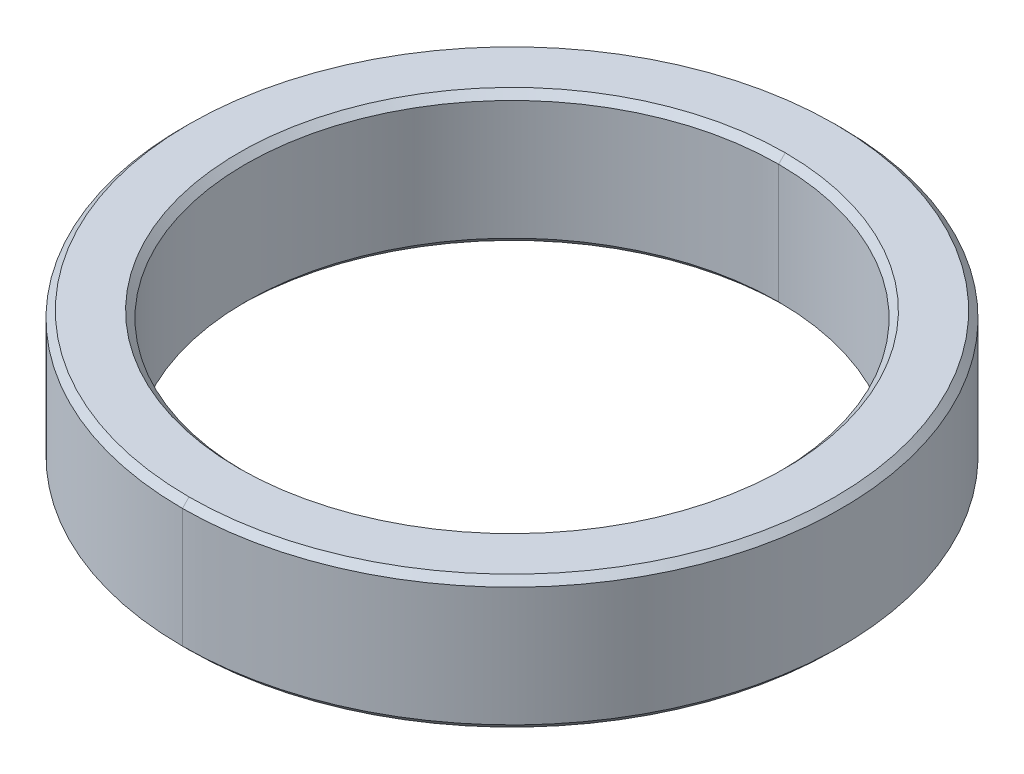
ISO-10303-21;
HEADER;
FILE_DESCRIPTION(('STEP AP214'),'2;1');
FILE_NAME('part.step','',(''),(''),'','','');
FILE_SCHEMA(('AUTOMOTIVE_DESIGN { 1 0 10303 214 1 1 1 1 }'));
ENDSEC;
DATA;
#1=APPLICATION_CONTEXT('core data for automotive mechanical design processes');
#2=APPLICATION_PROTOCOL_DEFINITION('international standard','automotive_design',2000,#1);
#3=PRODUCT_CONTEXT('',#1,'mechanical');
#4=PRODUCT('Part','Part','',(#3));
#5=PRODUCT_RELATED_PRODUCT_CATEGORY('part','',(#4));
#6=PRODUCT_DEFINITION_FORMATION('','',#4);
#7=PRODUCT_DEFINITION_CONTEXT('part definition',#1,'design');
#8=PRODUCT_DEFINITION('design','',#6,#7);
#9=PRODUCT_DEFINITION_SHAPE('','',#8);
#10=(LENGTH_UNIT() NAMED_UNIT(*) SI_UNIT(.MILLI.,.METRE.));
#11=(NAMED_UNIT(*) PLANE_ANGLE_UNIT() SI_UNIT($,.RADIAN.));
#12=(NAMED_UNIT(*) SI_UNIT($,.STERADIAN.) SOLID_ANGLE_UNIT());
#13=UNCERTAINTY_MEASURE_WITH_UNIT(LENGTH_MEASURE(1.E-05),#10,'distance_accuracy_value','');
#14=(GEOMETRIC_REPRESENTATION_CONTEXT(3) GLOBAL_UNCERTAINTY_ASSIGNED_CONTEXT((#13)) GLOBAL_UNIT_ASSIGNED_CONTEXT((#10,
#11,#12)) REPRESENTATION_CONTEXT('',''));
#15=CARTESIAN_POINT('',(0.,0.,0.));
#16=DIRECTION('',(0.,0.,1.));
#17=DIRECTION('',(1.,0.,0.));
#18=AXIS2_PLACEMENT_3D('',#15,#16,#17);
#19=CARTESIAN_POINT('',(0.,0.9,0.));
#20=DIRECTION('',(0.,1.,0.));
#21=DIRECTION('',(0.,0.,1.));
#22=AXIS2_PLACEMENT_3D('',#19,#20,#21);
#23=CONICAL_SURFACE('',#22,4.025,0.785398163397452);
#24=DIRECTION('',(0.,0.707106781186545,-0.707106781186551));
#25=VECTOR('',#24,1.);
#26=CARTESIAN_POINT('',(0.,0.9,-4.025));
#27=LINE('',#26,#25);
#28=CARTESIAN_POINT('',(0.,0.9,-4.025));
#29=VERTEX_POINT('',#28);
#30=CARTESIAN_POINT('',(0.,1.,-4.125));
#31=VERTEX_POINT('',#30);
#32=EDGE_CURVE('E189',#29,#31,#27,.T.);
#33=ORIENTED_EDGE('',*,*,#32,.F.);
#34=CARTESIAN_POINT('',(0.,0.9,0.));
#35=DIRECTION('',(0.,1.,0.));
#36=DIRECTION('',(0.,0.,1.));
#37=AXIS2_PLACEMENT_3D('',#34,#35,#36);
#38=CIRCLE('',#37,4.025);
#39=CARTESIAN_POINT('',(0.,0.9,4.025));
#40=VERTEX_POINT('',#39);
#41=EDGE_CURVE('E26',#40,#29,#38,.T.);
#42=ORIENTED_EDGE('',*,*,#41,.F.);
#43=DIRECTION('',(0.,0.707106781186545,0.707106781186551));
#44=VECTOR('',#43,1.);
#45=CARTESIAN_POINT('',(0.,0.9,4.025));
#46=LINE('',#45,#44);
#47=CARTESIAN_POINT('',(0.,1.,4.125));
#48=VERTEX_POINT('',#47);
#49=EDGE_CURVE('E183',#40,#48,#46,.T.);
#50=ORIENTED_EDGE('',*,*,#49,.T.);
#51=CARTESIAN_POINT('',(0.,1.,0.));
#52=DIRECTION('',(0.,-1.,0.));
#53=DIRECTION('',(0.,0.,1.));
#54=AXIS2_PLACEMENT_3D('',#51,#52,#53);
#55=CIRCLE('',#54,4.125);
#56=EDGE_CURVE('E65',#31,#48,#55,.T.);
#57=ORIENTED_EDGE('',*,*,#56,.F.);
#58=EDGE_LOOP('',(#33,#42,#50,#57));
#59=FACE_BOUND('',#58,.T.);
#60=ADVANCED_FACE('F15',(#59),#23,.F.);
#61=CARTESIAN_POINT('',(0.,-1.,0.));
#62=DIRECTION('',(0.,-1.,0.));
#63=DIRECTION('',(0.,0.,-1.));
#64=AXIS2_PLACEMENT_3D('',#61,#62,#63);
#65=CONICAL_SURFACE('',#64,4.125,0.785398163397448);
#66=DIRECTION('',(0.,-0.707106781186548,0.707106781186548));
#67=VECTOR('',#66,1.);
#68=CARTESIAN_POINT('',(0.,-1.,4.125));
#69=LINE('',#68,#67);
#70=CARTESIAN_POINT('',(0.,-0.9,4.025));
#71=VERTEX_POINT('',#70);
#72=CARTESIAN_POINT('',(0.,-1.,4.125));
#73=VERTEX_POINT('',#72);
#74=EDGE_CURVE('E164',#71,#73,#69,.T.);
#75=ORIENTED_EDGE('',*,*,#74,.F.);
#76=CARTESIAN_POINT('',(0.,-0.9,0.));
#77=DIRECTION('',(0.,-1.,0.));
#78=DIRECTION('',(0.,0.,1.));
#79=AXIS2_PLACEMENT_3D('',#76,#77,#78);
#80=CIRCLE('',#79,4.025);
#81=CARTESIAN_POINT('',(0.,-0.9,-4.025));
#82=VERTEX_POINT('',#81);
#83=EDGE_CURVE('E10',#82,#71,#80,.T.);
#84=ORIENTED_EDGE('',*,*,#83,.F.);
#85=DIRECTION('',(0.,-0.707106781186548,-0.707106781186548));
#86=VECTOR('',#85,1.);
#87=CARTESIAN_POINT('',(0.,-1.,-4.125));
#88=LINE('',#87,#86);
#89=CARTESIAN_POINT('',(0.,-1.,-4.125));
#90=VERTEX_POINT('',#89);
#91=EDGE_CURVE('E196',#82,#90,#88,.T.);
#92=ORIENTED_EDGE('',*,*,#91,.T.);
#93=CARTESIAN_POINT('',(0.,-1.,0.));
#94=DIRECTION('',(0.,1.,0.));
#95=DIRECTION('',(0.,0.,1.));
#96=AXIS2_PLACEMENT_3D('',#93,#94,#95);
#97=CIRCLE('',#96,4.125);
#98=EDGE_CURVE('E129',#73,#90,#97,.T.);
#99=ORIENTED_EDGE('',*,*,#98,.F.);
#100=EDGE_LOOP('',(#75,#84,#92,#99));
#101=FACE_BOUND('',#100,.T.);
#102=ADVANCED_FACE('F315',(#101),#65,.F.);
#103=CARTESIAN_POINT('',(0.,1.,0.));
#104=DIRECTION('',(0.,-1.,0.));
#105=DIRECTION('',(0.,0.,-1.));
#106=AXIS2_PLACEMENT_3D('',#103,#104,#105);
#107=CONICAL_SURFACE('',#106,4.875,0.785398163397453);
#108=DIRECTION('',(0.,-0.707106781186544,0.707106781186551));
#109=VECTOR('',#108,1.);
#110=CARTESIAN_POINT('',(0.,1.,4.875));
#111=LINE('',#110,#109);
#112=CARTESIAN_POINT('',(0.,1.,4.875));
#113=VERTEX_POINT('',#112);
#114=CARTESIAN_POINT('',(0.,0.9,4.975));
#115=VERTEX_POINT('',#114);
#116=EDGE_CURVE('E152',#113,#115,#111,.T.);
#117=ORIENTED_EDGE('',*,*,#116,.F.);
#118=CARTESIAN_POINT('',(0.,1.,0.));
#119=DIRECTION('',(0.,1.,0.));
#120=DIRECTION('',(0.,0.,1.));
#121=AXIS2_PLACEMENT_3D('',#118,#119,#120);
#122=CIRCLE('',#121,4.875);
#123=CARTESIAN_POINT('',(0.,1.,-4.875));
#124=VERTEX_POINT('',#123);
#125=EDGE_CURVE('E140',#124,#113,#122,.T.);
#126=ORIENTED_EDGE('',*,*,#125,.F.);
#127=DIRECTION('',(0.,-0.707106781186544,-0.707106781186551));
#128=VECTOR('',#127,1.);
#129=CARTESIAN_POINT('',(0.,1.,-4.875));
#130=LINE('',#129,#128);
#131=CARTESIAN_POINT('',(0.,0.9,-4.975));
#132=VERTEX_POINT('',#131);
#133=EDGE_CURVE('E143',#124,#132,#130,.T.);
#134=ORIENTED_EDGE('',*,*,#133,.T.);
#135=CARTESIAN_POINT('',(0.,0.9,0.));
#136=DIRECTION('',(0.,-1.,0.));
#137=DIRECTION('',(0.,0.,1.));
#138=AXIS2_PLACEMENT_3D('',#135,#136,#137);
#139=CIRCLE('',#138,4.975);
#140=EDGE_CURVE('E118',#115,#132,#139,.T.);
#141=ORIENTED_EDGE('',*,*,#140,.F.);
#142=EDGE_LOOP('',(#117,#126,#134,#141));
#143=FACE_BOUND('',#142,.T.);
#144=ADVANCED_FACE('F144',(#143),#107,.T.);
#145=CARTESIAN_POINT('',(0.,-0.9,0.));
#146=DIRECTION('',(0.,1.,0.));
#147=DIRECTION('',(0.,0.,1.));
#148=AXIS2_PLACEMENT_3D('',#145,#146,#147);
#149=CONICAL_SURFACE('',#148,4.975,0.785398163397448);
#150=DIRECTION('',(0.,0.707106781186548,-0.707106781186548));
#151=VECTOR('',#150,1.);
#152=CARTESIAN_POINT('',(0.,-0.9,-4.975));
#153=LINE('',#152,#151);
#154=CARTESIAN_POINT('',(0.,-1.,-4.875));
#155=VERTEX_POINT('',#154);
#156=CARTESIAN_POINT('',(0.,-0.9,-4.975));
#157=VERTEX_POINT('',#156);
#158=EDGE_CURVE('E166',#155,#157,#153,.T.);
#159=ORIENTED_EDGE('',*,*,#158,.F.);
#160=CARTESIAN_POINT('',(0.,-1.,0.));
#161=DIRECTION('',(0.,-1.,0.));
#162=DIRECTION('',(0.,0.,1.));
#163=AXIS2_PLACEMENT_3D('',#160,#161,#162);
#164=CIRCLE('',#163,4.875);
#165=CARTESIAN_POINT('',(0.,-1.,4.875));
#166=VERTEX_POINT('',#165);
#167=EDGE_CURVE('E108',#166,#155,#164,.T.);
#168=ORIENTED_EDGE('',*,*,#167,.F.);
#169=DIRECTION('',(0.,0.707106781186548,0.707106781186548));
#170=VECTOR('',#169,1.);
#171=CARTESIAN_POINT('',(0.,-0.9,4.975));
#172=LINE('',#171,#170);
#173=CARTESIAN_POINT('',(0.,-0.9,4.975));
#174=VERTEX_POINT('',#173);
#175=EDGE_CURVE('E178',#166,#174,#172,.T.);
#176=ORIENTED_EDGE('',*,*,#175,.T.);
#177=CARTESIAN_POINT('',(0.,-0.9,0.));
#178=DIRECTION('',(0.,1.,0.));
#179=DIRECTION('',(0.,0.,1.));
#180=AXIS2_PLACEMENT_3D('',#177,#178,#179);
#181=CIRCLE('',#180,4.975);
#182=EDGE_CURVE('E41',#157,#174,#181,.T.);
#183=ORIENTED_EDGE('',*,*,#182,.F.);
#184=EDGE_LOOP('',(#159,#168,#176,#183));
#185=FACE_BOUND('',#184,.T.);
#186=ADVANCED_FACE('F269',(#185),#149,.T.);
#187=CARTESIAN_POINT('',(0.,1.,0.));
#188=DIRECTION('',(0.,-1.,0.));
#189=DIRECTION('',(0.,0.,-1.));
#190=AXIS2_PLACEMENT_3D('',#187,#188,#189);
#191=CYLINDRICAL_SURFACE('',#190,4.025);
#192=DIRECTION('',(0.,-1.,0.));
#193=VECTOR('',#192,1.);
#194=CARTESIAN_POINT('',(0.,1.,4.025));
#195=LINE('',#194,#193);
#196=EDGE_CURVE('E174',#40,#71,#195,.T.);
#197=ORIENTED_EDGE('',*,*,#196,.F.);
#198=ORIENTED_EDGE('',*,*,#41,.T.);
#199=DIRECTION('',(0.,-1.,0.));
#200=VECTOR('',#199,1.);
#201=CARTESIAN_POINT('',(0.,1.,-4.025));
#202=LINE('',#201,#200);
#203=EDGE_CURVE('E170',#29,#82,#202,.T.);
#204=ORIENTED_EDGE('',*,*,#203,.T.);
#205=ORIENTED_EDGE('',*,*,#83,.T.);
#206=EDGE_LOOP('',(#197,#198,#204,#205));
#207=FACE_BOUND('',#206,.T.);
#208=ADVANCED_FACE('F248',(#207),#191,.F.);
#209=CARTESIAN_POINT('',(0.,1.,0.));
#210=DIRECTION('',(0.,-1.,0.));
#211=DIRECTION('',(0.,0.,-1.));
#212=AXIS2_PLACEMENT_3D('',#209,#210,#211);
#213=CYLINDRICAL_SURFACE('',#212,4.975);
#214=DIRECTION('',(0.,-1.,0.));
#215=VECTOR('',#214,1.);
#216=CARTESIAN_POINT('',(0.,1.,4.975));
#217=LINE('',#216,#215);
#218=EDGE_CURVE('E123',#115,#174,#217,.T.);
#219=ORIENTED_EDGE('',*,*,#218,.F.);
#220=ORIENTED_EDGE('',*,*,#140,.T.);
#221=DIRECTION('',(0.,-1.,0.));
#222=VECTOR('',#221,1.);
#223=CARTESIAN_POINT('',(0.,1.,-4.975));
#224=LINE('',#223,#222);
#225=EDGE_CURVE('E121',#132,#157,#224,.T.);
#226=ORIENTED_EDGE('',*,*,#225,.T.);
#227=ORIENTED_EDGE('',*,*,#182,.T.);
#228=EDGE_LOOP('',(#219,#220,#226,#227));
#229=FACE_BOUND('',#228,.T.);
#230=ADVANCED_FACE('F120',(#229),#213,.T.);
#231=CARTESIAN_POINT('',(0.,-1.,0.));
#232=DIRECTION('',(0.,1.,0.));
#233=DIRECTION('',(1.,0.,0.));
#234=AXIS2_PLACEMENT_3D('',#231,#232,#233);
#235=PLANE('',#234);
#236=CARTESIAN_POINT('',(0.,-1.,0.));
#237=DIRECTION('',(0.,1.,0.));
#238=DIRECTION('',(0.,0.,1.));
#239=AXIS2_PLACEMENT_3D('',#236,#237,#238);
#240=CIRCLE('',#239,4.125);
#241=EDGE_CURVE('E199',#90,#73,#240,.T.);
#242=ORIENTED_EDGE('',*,*,#241,.T.);
#243=ORIENTED_EDGE('',*,*,#98,.T.);
#244=EDGE_LOOP('',(#242,#243));
#245=FACE_BOUND('',#244,.T.);
#246=ORIENTED_EDGE('',*,*,#167,.T.);
#247=CARTESIAN_POINT('',(0.,-1.,0.));
#248=DIRECTION('',(0.,-1.,0.));
#249=DIRECTION('',(0.,0.,1.));
#250=AXIS2_PLACEMENT_3D('',#247,#248,#249);
#251=CIRCLE('',#250,4.875);
#252=EDGE_CURVE('E149',#155,#166,#251,.T.);
#253=ORIENTED_EDGE('',*,*,#252,.T.);
#254=EDGE_LOOP('',(#246,#253));
#255=FACE_BOUND('',#254,.T.);
#256=ADVANCED_FACE('F17',(#245,#255),#235,.F.);
#257=CARTESIAN_POINT('',(0.,1.,0.));
#258=DIRECTION('',(0.,1.,0.));
#259=DIRECTION('',(1.,0.,0.));
#260=AXIS2_PLACEMENT_3D('',#257,#258,#259);
#261=PLANE('',#260);
#262=CARTESIAN_POINT('',(0.,1.,0.));
#263=DIRECTION('',(0.,-1.,0.));
#264=DIRECTION('',(0.,0.,1.));
#265=AXIS2_PLACEMENT_3D('',#262,#263,#264);
#266=CIRCLE('',#265,4.125);
#267=EDGE_CURVE('E186',#48,#31,#266,.T.);
#268=ORIENTED_EDGE('',*,*,#267,.T.);
#269=ORIENTED_EDGE('',*,*,#56,.T.);
#270=EDGE_LOOP('',(#268,#269));
#271=FACE_BOUND('',#270,.T.);
#272=ORIENTED_EDGE('',*,*,#125,.T.);
#273=CARTESIAN_POINT('',(0.,1.,0.));
#274=DIRECTION('',(0.,1.,0.));
#275=DIRECTION('',(0.,0.,1.));
#276=AXIS2_PLACEMENT_3D('',#273,#274,#275);
#277=CIRCLE('',#276,4.875);
#278=EDGE_CURVE('E160',#113,#124,#277,.T.);
#279=ORIENTED_EDGE('',*,*,#278,.T.);
#280=EDGE_LOOP('',(#272,#279));
#281=FACE_BOUND('',#280,.T.);
#282=ADVANCED_FACE('F218',(#271,#281),#261,.T.);
#283=CARTESIAN_POINT('',(0.,1.,0.));
#284=DIRECTION('',(0.,-1.,0.));
#285=DIRECTION('',(0.,0.,-1.));
#286=AXIS2_PLACEMENT_3D('',#283,#284,#285);
#287=CYLINDRICAL_SURFACE('',#286,4.975);
#288=CARTESIAN_POINT('',(0.,0.9,0.));
#289=DIRECTION('',(0.,-1.,0.));
#290=DIRECTION('',(0.,0.,1.));
#291=AXIS2_PLACEMENT_3D('',#288,#289,#290);
#292=CIRCLE('',#291,4.975);
#293=EDGE_CURVE('E134',#132,#115,#292,.T.);
#294=ORIENTED_EDGE('',*,*,#293,.T.);
#295=ORIENTED_EDGE('',*,*,#218,.T.);
#296=CARTESIAN_POINT('',(0.,-0.9,0.));
#297=DIRECTION('',(0.,1.,0.));
#298=DIRECTION('',(0.,0.,1.));
#299=AXIS2_PLACEMENT_3D('',#296,#297,#298);
#300=CIRCLE('',#299,4.975);
#301=EDGE_CURVE('E137',#174,#157,#300,.T.);
#302=ORIENTED_EDGE('',*,*,#301,.T.);
#303=ORIENTED_EDGE('',*,*,#225,.F.);
#304=EDGE_LOOP('',(#294,#295,#302,#303));
#305=FACE_BOUND('',#304,.T.);
#306=ADVANCED_FACE('F132',(#305),#287,.T.);
#307=CARTESIAN_POINT('',(0.,1.,0.));
#308=DIRECTION('',(0.,-1.,0.));
#309=DIRECTION('',(0.,0.,-1.));
#310=AXIS2_PLACEMENT_3D('',#307,#308,#309);
#311=CYLINDRICAL_SURFACE('',#310,4.025);
#312=CARTESIAN_POINT('',(0.,0.9,0.));
#313=DIRECTION('',(0.,1.,0.));
#314=DIRECTION('',(0.,0.,1.));
#315=AXIS2_PLACEMENT_3D('',#312,#313,#314);
#316=CIRCLE('',#315,4.025);
#317=EDGE_CURVE('E19',#29,#40,#316,.T.);
#318=ORIENTED_EDGE('',*,*,#317,.T.);
#319=ORIENTED_EDGE('',*,*,#196,.T.);
#320=CARTESIAN_POINT('',(0.,-0.9,0.));
#321=DIRECTION('',(0.,-1.,0.));
#322=DIRECTION('',(0.,0.,1.));
#323=AXIS2_PLACEMENT_3D('',#320,#321,#322);
#324=CIRCLE('',#323,4.025);
#325=EDGE_CURVE('E179',#71,#82,#324,.T.);
#326=ORIENTED_EDGE('',*,*,#325,.T.);
#327=ORIENTED_EDGE('',*,*,#203,.F.);
#328=EDGE_LOOP('',(#318,#319,#326,#327));
#329=FACE_BOUND('',#328,.T.);
#330=ADVANCED_FACE('F236',(#329),#311,.F.);
#331=CARTESIAN_POINT('',(0.,-0.9,0.));
#332=DIRECTION('',(0.,1.,0.));
#333=DIRECTION('',(0.,0.,1.));
#334=AXIS2_PLACEMENT_3D('',#331,#332,#333);
#335=CONICAL_SURFACE('',#334,4.975,0.785398163397448);
#336=ORIENTED_EDGE('',*,*,#252,.F.);
#337=ORIENTED_EDGE('',*,*,#158,.T.);
#338=ORIENTED_EDGE('',*,*,#301,.F.);
#339=ORIENTED_EDGE('',*,*,#175,.F.);
#340=EDGE_LOOP('',(#336,#337,#338,#339));
#341=FACE_BOUND('',#340,.T.);
#342=ADVANCED_FACE('F256',(#341),#335,.T.);
#343=CARTESIAN_POINT('',(0.,1.,0.));
#344=DIRECTION('',(0.,-1.,0.));
#345=DIRECTION('',(0.,0.,-1.));
#346=AXIS2_PLACEMENT_3D('',#343,#344,#345);
#347=CONICAL_SURFACE('',#346,4.875,0.785398163397453);
#348=ORIENTED_EDGE('',*,*,#278,.F.);
#349=ORIENTED_EDGE('',*,*,#116,.T.);
#350=ORIENTED_EDGE('',*,*,#293,.F.);
#351=ORIENTED_EDGE('',*,*,#133,.F.);
#352=EDGE_LOOP('',(#348,#349,#350,#351));
#353=FACE_BOUND('',#352,.T.);
#354=ADVANCED_FACE('F151',(#353),#347,.T.);
#355=CARTESIAN_POINT('',(0.,-1.,0.));
#356=DIRECTION('',(0.,-1.,0.));
#357=DIRECTION('',(0.,0.,-1.));
#358=AXIS2_PLACEMENT_3D('',#355,#356,#357);
#359=CONICAL_SURFACE('',#358,4.125,0.785398163397448);
#360=ORIENTED_EDGE('',*,*,#325,.F.);
#361=ORIENTED_EDGE('',*,*,#74,.T.);
#362=ORIENTED_EDGE('',*,*,#241,.F.);
#363=ORIENTED_EDGE('',*,*,#91,.F.);
#364=EDGE_LOOP('',(#360,#361,#362,#363));
#365=FACE_BOUND('',#364,.T.);
#366=ADVANCED_FACE('F286',(#365),#359,.F.);
#367=CARTESIAN_POINT('',(0.,0.9,0.));
#368=DIRECTION('',(0.,1.,0.));
#369=DIRECTION('',(0.,0.,1.));
#370=AXIS2_PLACEMENT_3D('',#367,#368,#369);
#371=CONICAL_SURFACE('',#370,4.025,0.785398163397452);
#372=ORIENTED_EDGE('',*,*,#317,.F.);
#373=ORIENTED_EDGE('',*,*,#32,.T.);
#374=ORIENTED_EDGE('',*,*,#267,.F.);
#375=ORIENTED_EDGE('',*,*,#49,.F.);
#376=EDGE_LOOP('',(#372,#373,#374,#375));
#377=FACE_BOUND('',#376,.T.);
#378=ADVANCED_FACE('F281',(#377),#371,.F.);
#379=CLOSED_SHELL('',(#60,#102,#144,#186,#208,#230,#256,#282,#306,#330,#342,#354,#366,#378));
#380=MANIFOLD_SOLID_BREP('B1',#379);
#381=ADVANCED_BREP_SHAPE_REPRESENTATION('',(#18,#380),#14);
#382=SHAPE_DEFINITION_REPRESENTATION(#9,#381);
ENDSEC;
END-ISO-10303-21;
